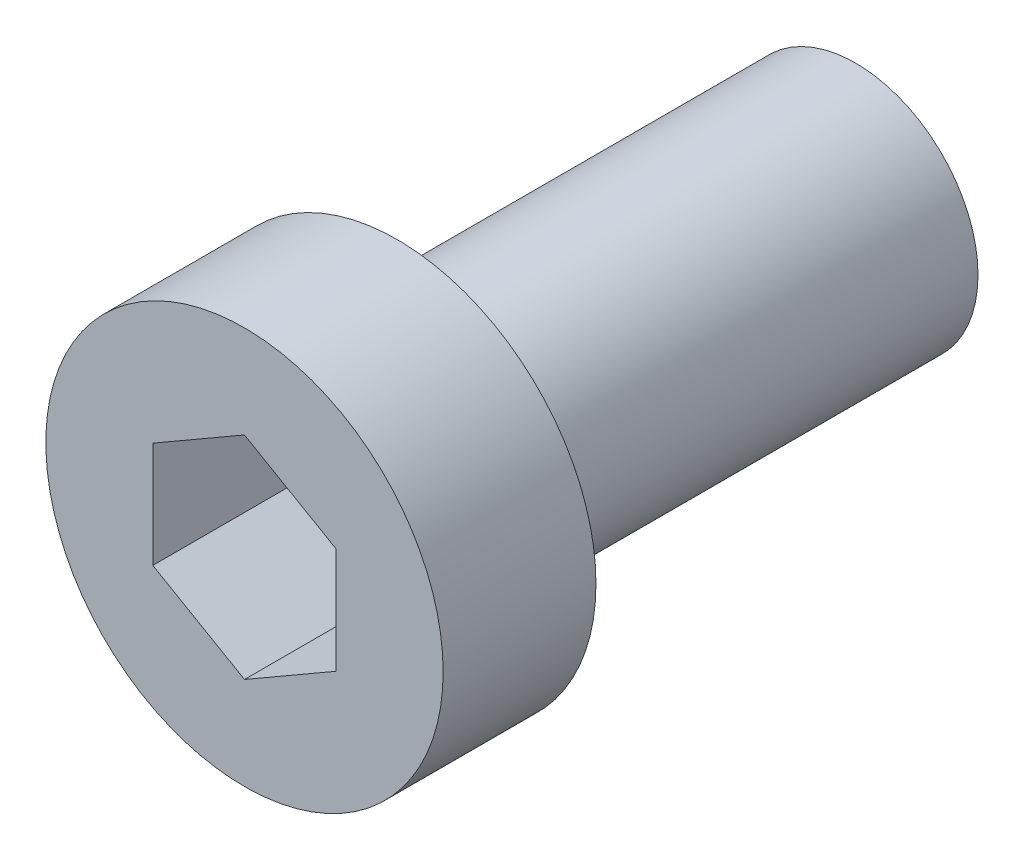
ISO-10303-21;
HEADER;
FILE_DESCRIPTION(('STEP AP214'),'2;1');
FILE_NAME('part.step','',(''),(''),'','','');
FILE_SCHEMA(('AUTOMOTIVE_DESIGN { 1 0 10303 214 1 1 1 1 }'));
ENDSEC;
DATA;
#1=APPLICATION_CONTEXT('core data for automotive mechanical design processes');
#2=APPLICATION_PROTOCOL_DEFINITION('international standard','automotive_design',2000,#1);
#3=PRODUCT_CONTEXT('',#1,'mechanical');
#4=PRODUCT('Part','Part','',(#3));
#5=PRODUCT_RELATED_PRODUCT_CATEGORY('part','',(#4));
#6=PRODUCT_DEFINITION_FORMATION('','',#4);
#7=PRODUCT_DEFINITION_CONTEXT('part definition',#1,'design');
#8=PRODUCT_DEFINITION('design','',#6,#7);
#9=PRODUCT_DEFINITION_SHAPE('','',#8);
#10=(LENGTH_UNIT() NAMED_UNIT(*) SI_UNIT(.MILLI.,.METRE.));
#11=(NAMED_UNIT(*) PLANE_ANGLE_UNIT() SI_UNIT($,.RADIAN.));
#12=(NAMED_UNIT(*) SI_UNIT($,.STERADIAN.) SOLID_ANGLE_UNIT());
#13=UNCERTAINTY_MEASURE_WITH_UNIT(LENGTH_MEASURE(1.E-05),#10,'distance_accuracy_value','');
#14=(GEOMETRIC_REPRESENTATION_CONTEXT(3) GLOBAL_UNCERTAINTY_ASSIGNED_CONTEXT((#13)) GLOBAL_UNIT_ASSIGNED_CONTEXT((#10,
#11,#12)) REPRESENTATION_CONTEXT('',''));
#15=CARTESIAN_POINT('',(0.,0.,0.));
#16=DIRECTION('',(0.,0.,1.));
#17=DIRECTION('',(1.,0.,0.));
#18=AXIS2_PLACEMENT_3D('',#15,#16,#17);
#19=CARTESIAN_POINT('',(0.,0.,4.44089209850063E-13));
#20=DIRECTION('',(0.,0.,0.99999999999998));
#21=DIRECTION('',(1.,0.,0.));
#22=AXIS2_PLACEMENT_3D('',#19,#20,#21);
#23=PLANE('',#22);
#24=CARTESIAN_POINT('',(0.,0.,4.44089209850063E-13));
#25=DIRECTION('',(0.,0.,0.99999999999998));
#26=DIRECTION('',(1.,0.,0.));
#27=AXIS2_PLACEMENT_3D('',#24,#25,#26);
#28=CIRCLE('',#27,6.5);
#29=CARTESIAN_POINT('',(6.5,0.,4.47813769070422E-13));
#30=VERTEX_POINT('',#29);
#31=EDGE_CURVE('E144',#30,#30,#28,.T.);
#32=ORIENTED_EDGE('',*,*,#31,.F.);
#33=EDGE_LOOP('',(#32));
#34=FACE_BOUND('',#33,.T.);
#35=CARTESIAN_POINT('',(0.,0.,4.44089209850063E-13));
#36=DIRECTION('',(0.,0.,0.99999999999998));
#37=DIRECTION('',(1.,0.,0.));
#38=AXIS2_PLACEMENT_3D('',#35,#36,#37);
#39=CIRCLE('',#38,4.);
#40=CARTESIAN_POINT('',(4.,0.,4.46381246293361E-13));
#41=VERTEX_POINT('',#40);
#42=EDGE_CURVE('E11',#41,#41,#39,.F.);
#43=ORIENTED_EDGE('',*,*,#42,.F.);
#44=EDGE_LOOP('',(#43));
#45=FACE_BOUND('',#44,.T.);
#46=ADVANCED_FACE('F34',(#34,#45),#23,.F.);
#47=CARTESIAN_POINT('',(0.,0.,4.99999999999823));
#48=DIRECTION('',(0.,0.,-0.99999999999998));
#49=DIRECTION('',(-1.,0.,0.));
#50=AXIS2_PLACEMENT_3D('',#47,#48,#49);
#51=CYLINDRICAL_SURFACE('',#50,6.5);
#52=CARTESIAN_POINT('',(0.,0.,4.99999999999823));
#53=DIRECTION('',(0.,0.,0.99999999999998));
#54=DIRECTION('',(1.,0.,0.));
#55=AXIS2_PLACEMENT_3D('',#52,#53,#54);
#56=CIRCLE('',#55,6.5);
#57=CARTESIAN_POINT('',(6.5,0.,4.99999999999823));
#58=VERTEX_POINT('',#57);
#59=EDGE_CURVE('E42',#58,#58,#56,.T.);
#60=ORIENTED_EDGE('',*,*,#59,.F.);
#61=EDGE_LOOP('',(#60));
#62=FACE_BOUND('',#61,.T.);
#63=ORIENTED_EDGE('',*,*,#31,.T.);
#64=EDGE_LOOP('',(#63));
#65=FACE_BOUND('',#64,.T.);
#66=ADVANCED_FACE('F36',(#62,#65),#51,.T.);
#67=CARTESIAN_POINT('',(0.,0.,4.99999999999823));
#68=DIRECTION('',(0.,0.,0.99999999999998));
#69=DIRECTION('',(1.,0.,0.));
#70=AXIS2_PLACEMENT_3D('',#67,#68,#69);
#71=PLANE('',#70);
#72=DIRECTION('',(-0.866025403784439,0.50000000000001,0.));
#73=VECTOR('',#72,1.);
#74=CARTESIAN_POINT('',(2.99999999999989,1.73205080756874,4.99999999999778));
#75=LINE('',#74,#73);
#76=CARTESIAN_POINT('',(2.99999999999989,1.73205080756874,4.99999999999778));
#77=VERTEX_POINT('',#76);
#78=CARTESIAN_POINT('',(0.,3.46410161513778,4.99999999999834));
#79=VERTEX_POINT('',#78);
#80=EDGE_CURVE('E49',#77,#79,#75,.T.);
#81=ORIENTED_EDGE('',*,*,#80,.F.);
#82=DIRECTION('',(0.,1.00000000000002,0.));
#83=VECTOR('',#82,1.);
#84=CARTESIAN_POINT('',(2.99999999999989,-1.73205080756893,4.9999999999979));
#85=LINE('',#84,#83);
#86=CARTESIAN_POINT('',(2.99999999999989,-1.73205080756893,4.9999999999979));
#87=VERTEX_POINT('',#86);
#88=EDGE_CURVE('E132',#87,#77,#85,.T.);
#89=ORIENTED_EDGE('',*,*,#88,.F.);
#90=DIRECTION('',(0.866025403784439,0.500000000000009,0.));
#91=VECTOR('',#90,1.);
#92=CARTESIAN_POINT('',(0.,-3.46410161513781,4.99999999999934));
#93=LINE('',#92,#91);
#94=CARTESIAN_POINT('',(0.,-3.46410161513781,4.99999999999934));
#95=VERTEX_POINT('',#94);
#96=EDGE_CURVE('E130',#95,#87,#93,.T.);
#97=ORIENTED_EDGE('',*,*,#96,.F.);
#98=DIRECTION('',(0.866025403784439,-0.500000000000009,0.));
#99=VECTOR('',#98,1.);
#100=CARTESIAN_POINT('',(-3.00000000000011,-1.73205080756885,4.99999999999834));
#101=LINE('',#100,#99);
#102=CARTESIAN_POINT('',(-3.00000000000011,-1.73205080756885,4.99999999999834));
#103=VERTEX_POINT('',#102);
#104=EDGE_CURVE('E97',#103,#95,#101,.T.);
#105=ORIENTED_EDGE('',*,*,#104,.F.);
#106=DIRECTION('',(0.,-1.00000000000002,0.));
#107=VECTOR('',#106,1.);
#108=CARTESIAN_POINT('',(-2.99999999999989,1.73205080756896,4.99999999999823));
#109=LINE('',#108,#107);
#110=CARTESIAN_POINT('',(-2.99999999999989,1.73205080756896,4.99999999999823));
#111=VERTEX_POINT('',#110);
#112=EDGE_CURVE('E126',#111,#103,#109,.T.);
#113=ORIENTED_EDGE('',*,*,#112,.F.);
#114=DIRECTION('',(-0.866025403784439,-0.500000000000009,0.));
#115=VECTOR('',#114,1.);
#116=CARTESIAN_POINT('',(0.,3.46410161513778,4.99999999999834));
#117=LINE('',#116,#115);
#118=EDGE_CURVE('E123',#79,#111,#117,.T.);
#119=ORIENTED_EDGE('',*,*,#118,.F.);
#120=EDGE_LOOP('',(#81,#89,#97,#105,#113,#119));
#121=FACE_BOUND('',#120,.T.);
#122=ORIENTED_EDGE('',*,*,#59,.T.);
#123=EDGE_LOOP('',(#122));
#124=FACE_BOUND('',#123,.T.);
#125=ADVANCED_FACE('F157',(#121,#124),#71,.T.);
#126=CARTESIAN_POINT('',(0.,0.,-14.9999999999996));
#127=DIRECTION('',(0.,0.,0.99999999999998));
#128=DIRECTION('',(1.,0.,0.));
#129=AXIS2_PLACEMENT_3D('',#126,#127,#128);
#130=CYLINDRICAL_SURFACE('',#129,4.);
#131=CARTESIAN_POINT('',(0.,0.,-14.9999999999996));
#132=DIRECTION('',(0.,0.,-0.99999999999998));
#133=DIRECTION('',(-1.,0.,0.));
#134=AXIS2_PLACEMENT_3D('',#131,#132,#133);
#135=CIRCLE('',#134,4.);
#136=CARTESIAN_POINT('',(-4.,0.,-14.9999999999996));
#137=VERTEX_POINT('',#136);
#138=EDGE_CURVE('E136',#137,#137,#135,.T.);
#139=ORIENTED_EDGE('',*,*,#138,.F.);
#140=EDGE_LOOP('',(#139));
#141=FACE_BOUND('',#140,.T.);
#142=ORIENTED_EDGE('',*,*,#42,.T.);
#143=EDGE_LOOP('',(#142));
#144=FACE_BOUND('',#143,.T.);
#145=ADVANCED_FACE('F154',(#141,#144),#130,.T.);
#146=CARTESIAN_POINT('',(0.,0.,-14.9999999999996));
#147=DIRECTION('',(0.,0.,-0.99999999999998));
#148=DIRECTION('',(-1.,0.,0.));
#149=AXIS2_PLACEMENT_3D('',#146,#147,#148);
#150=PLANE('',#149);
#151=ORIENTED_EDGE('',*,*,#138,.T.);
#152=EDGE_LOOP('',(#151));
#153=FACE_BOUND('',#152,.T.);
#154=ADVANCED_FACE('F156',(#153),#150,.T.);
#155=CARTESIAN_POINT('',(2.99999999999989,1.73205080756881,0.));
#156=DIRECTION('',(0.5,0.866025403784458,0.));
#157=DIRECTION('',(-0.866025403784439,0.50000000000001,0.));
#158=AXIS2_PLACEMENT_3D('',#155,#156,#157);
#159=PLANE('',#158);
#160=ORIENTED_EDGE('',*,*,#80,.T.);
#161=DIRECTION('',(0.,0.,0.99999999999998));
#162=VECTOR('',#161,1.);
#163=CARTESIAN_POINT('',(0.,3.46410161513774,4.44089209850063E-13));
#164=LINE('',#163,#162);
#165=CARTESIAN_POINT('',(0.,3.46410161513774,4.44089209850063E-13));
#166=VERTEX_POINT('',#165);
#167=EDGE_CURVE('E79',#166,#79,#164,.T.);
#168=ORIENTED_EDGE('',*,*,#167,.F.);
#169=DIRECTION('',(-0.866025403784439,0.50000000000001,0.));
#170=VECTOR('',#169,1.);
#171=CARTESIAN_POINT('',(2.99999999999989,1.73205080756881,0.));
#172=LINE('',#171,#170);
#173=CARTESIAN_POINT('',(2.99999999999989,1.73205080756881,0.));
#174=VERTEX_POINT('',#173);
#175=EDGE_CURVE('E134',#174,#166,#172,.T.);
#176=ORIENTED_EDGE('',*,*,#175,.F.);
#177=DIRECTION('',(0.,0.,0.99999999999998));
#178=VECTOR('',#177,1.);
#179=CARTESIAN_POINT('',(2.99999999999989,1.73205080756881,0.));
#180=LINE('',#179,#178);
#181=EDGE_CURVE('E57',#174,#77,#180,.T.);
#182=ORIENTED_EDGE('',*,*,#181,.T.);
#183=EDGE_LOOP('',(#160,#168,#176,#182));
#184=FACE_BOUND('',#183,.T.);
#185=ADVANCED_FACE('F164',(#184),#159,.F.);
#186=CARTESIAN_POINT('',(2.99999999999989,-1.73205080756888,0.));
#187=DIRECTION('',(1.,0.,0.));
#188=DIRECTION('',(0.,0.,-0.99999999999998));
#189=AXIS2_PLACEMENT_3D('',#186,#187,#188);
#190=PLANE('',#189);
#191=ORIENTED_EDGE('',*,*,#88,.T.);
#192=ORIENTED_EDGE('',*,*,#181,.F.);
#193=DIRECTION('',(0.,1.00000000000002,0.));
#194=VECTOR('',#193,1.);
#195=CARTESIAN_POINT('',(2.99999999999989,-1.73205080756888,0.));
#196=LINE('',#195,#194);
#197=CARTESIAN_POINT('',(2.99999999999989,-1.73205080756888,0.));
#198=VERTEX_POINT('',#197);
#199=EDGE_CURVE('E109',#198,#174,#196,.T.);
#200=ORIENTED_EDGE('',*,*,#199,.F.);
#201=DIRECTION('',(0.,0.,0.99999999999998));
#202=VECTOR('',#201,1.);
#203=CARTESIAN_POINT('',(2.99999999999989,-1.73205080756888,0.));
#204=LINE('',#203,#202);
#205=EDGE_CURVE('E101',#198,#87,#204,.T.);
#206=ORIENTED_EDGE('',*,*,#205,.T.);
#207=EDGE_LOOP('',(#191,#192,#200,#206));
#208=FACE_BOUND('',#207,.T.);
#209=ADVANCED_FACE('F173',(#208),#190,.F.);
#210=CARTESIAN_POINT('',(0.,-3.46410161513789,4.44089209850063E-13));
#211=DIRECTION('',(0.500000000000001,-0.866025403784458,0.));
#212=DIRECTION('',(0.866025403784439,0.500000000000009,0.));
#213=AXIS2_PLACEMENT_3D('',#210,#211,#212);
#214=PLANE('',#213);
#215=ORIENTED_EDGE('',*,*,#96,.T.);
#216=ORIENTED_EDGE('',*,*,#205,.F.);
#217=DIRECTION('',(0.866025403784439,0.500000000000009,0.));
#218=VECTOR('',#217,1.);
#219=CARTESIAN_POINT('',(0.,-3.46410161513789,4.44089209850063E-13));
#220=LINE('',#219,#218);
#221=CARTESIAN_POINT('',(0.,-3.46410161513789,4.44089209850063E-13));
#222=VERTEX_POINT('',#221);
#223=EDGE_CURVE('E105',#222,#198,#220,.T.);
#224=ORIENTED_EDGE('',*,*,#223,.F.);
#225=DIRECTION('',(0.,0.,0.99999999999998));
#226=VECTOR('',#225,1.);
#227=CARTESIAN_POINT('',(0.,-3.46410161513789,4.44089209850063E-13));
#228=LINE('',#227,#226);
#229=EDGE_CURVE('E90',#222,#95,#228,.T.);
#230=ORIENTED_EDGE('',*,*,#229,.T.);
#231=EDGE_LOOP('',(#215,#216,#224,#230));
#232=FACE_BOUND('',#231,.T.);
#233=ADVANCED_FACE('F106',(#232),#214,.F.);
#234=CARTESIAN_POINT('',(-3.00000000000011,-1.73205080756889,4.44089209850063E-13));
#235=DIRECTION('',(-0.5,-0.866025403784458,0.));
#236=DIRECTION('',(0.866025403784439,-0.500000000000009,0.));
#237=AXIS2_PLACEMENT_3D('',#234,#235,#236);
#238=PLANE('',#237);
#239=ORIENTED_EDGE('',*,*,#104,.T.);
#240=ORIENTED_EDGE('',*,*,#229,.F.);
#241=DIRECTION('',(0.866025403784439,-0.500000000000009,0.));
#242=VECTOR('',#241,1.);
#243=CARTESIAN_POINT('',(-3.00000000000011,-1.73205080756889,4.44089209850063E-13));
#244=LINE('',#243,#242);
#245=CARTESIAN_POINT('',(-3.00000000000011,-1.73205080756889,4.44089209850063E-13));
#246=VERTEX_POINT('',#245);
#247=EDGE_CURVE('E94',#246,#222,#244,.T.);
#248=ORIENTED_EDGE('',*,*,#247,.F.);
#249=DIRECTION('',(0.,0.,0.99999999999998));
#250=VECTOR('',#249,1.);
#251=CARTESIAN_POINT('',(-3.00000000000011,-1.73205080756889,4.44089209850063E-13));
#252=LINE('',#251,#250);
#253=EDGE_CURVE('E102',#246,#103,#252,.T.);
#254=ORIENTED_EDGE('',*,*,#253,.T.);
#255=EDGE_LOOP('',(#239,#240,#248,#254));
#256=FACE_BOUND('',#255,.T.);
#257=ADVANCED_FACE('F92',(#256),#238,.F.);
#258=CARTESIAN_POINT('',(-2.99999999999989,1.73205080756889,4.44089209850063E-13));
#259=DIRECTION('',(-1.,0.,0.));
#260=DIRECTION('',(0.,-1.00000000000002,0.));
#261=AXIS2_PLACEMENT_3D('',#258,#259,#260);
#262=PLANE('',#261);
#263=ORIENTED_EDGE('',*,*,#112,.T.);
#264=ORIENTED_EDGE('',*,*,#253,.F.);
#265=DIRECTION('',(0.,-1.00000000000002,0.));
#266=VECTOR('',#265,1.);
#267=CARTESIAN_POINT('',(-2.99999999999989,1.73205080756889,4.44089209850063E-13));
#268=LINE('',#267,#266);
#269=CARTESIAN_POINT('',(-2.99999999999989,1.73205080756889,4.44089209850063E-13));
#270=VERTEX_POINT('',#269);
#271=EDGE_CURVE('E115',#270,#246,#268,.T.);
#272=ORIENTED_EDGE('',*,*,#271,.F.);
#273=DIRECTION('',(0.,0.,0.99999999999998));
#274=VECTOR('',#273,1.);
#275=CARTESIAN_POINT('',(-2.99999999999989,1.73205080756889,4.44089209850063E-13));
#276=LINE('',#275,#274);
#277=EDGE_CURVE('E139',#270,#111,#276,.T.);
#278=ORIENTED_EDGE('',*,*,#277,.T.);
#279=EDGE_LOOP('',(#263,#264,#272,#278));
#280=FACE_BOUND('',#279,.T.);
#281=ADVANCED_FACE('F177',(#280),#262,.F.);
#282=CARTESIAN_POINT('',(0.,3.46410161513774,4.44089209850063E-13));
#283=DIRECTION('',(-0.500000000000001,0.866025403784458,0.));
#284=DIRECTION('',(-0.866025403784439,-0.50000000000001,0.));
#285=AXIS2_PLACEMENT_3D('',#282,#283,#284);
#286=PLANE('',#285);
#287=ORIENTED_EDGE('',*,*,#118,.T.);
#288=ORIENTED_EDGE('',*,*,#277,.F.);
#289=DIRECTION('',(-0.866025403784439,-0.500000000000009,0.));
#290=VECTOR('',#289,1.);
#291=CARTESIAN_POINT('',(0.,3.46410161513774,4.44089209850063E-13));
#292=LINE('',#291,#290);
#293=EDGE_CURVE('E117',#166,#270,#292,.T.);
#294=ORIENTED_EDGE('',*,*,#293,.F.);
#295=ORIENTED_EDGE('',*,*,#167,.T.);
#296=EDGE_LOOP('',(#287,#288,#294,#295));
#297=FACE_BOUND('',#296,.T.);
#298=ADVANCED_FACE('F174',(#297),#286,.F.);
#299=CARTESIAN_POINT('',(-2.99999999999989,5.19615242270663,4.44089209850063E-13));
#300=DIRECTION('',(0.,0.,0.99999999999998));
#301=DIRECTION('',(1.,0.,0.));
#302=AXIS2_PLACEMENT_3D('',#299,#300,#301);
#303=PLANE('',#302);
#304=ORIENTED_EDGE('',*,*,#175,.T.);
#305=ORIENTED_EDGE('',*,*,#293,.T.);
#306=ORIENTED_EDGE('',*,*,#271,.T.);
#307=ORIENTED_EDGE('',*,*,#247,.T.);
#308=ORIENTED_EDGE('',*,*,#223,.T.);
#309=ORIENTED_EDGE('',*,*,#199,.T.);
#310=EDGE_LOOP('',(#304,#305,#306,#307,#308,#309));
#311=FACE_BOUND('',#310,.T.);
#312=ADVANCED_FACE('F112',(#311),#303,.T.);
#313=CLOSED_SHELL('',(#46,#66,#125,#145,#154,#185,#209,#233,#257,#281,#298,#312));
#314=MANIFOLD_SOLID_BREP('B2',#313);
#315=ADVANCED_BREP_SHAPE_REPRESENTATION('',(#18,#314),#14);
#316=SHAPE_DEFINITION_REPRESENTATION(#9,#315);
ENDSEC;
END-ISO-10303-21;
